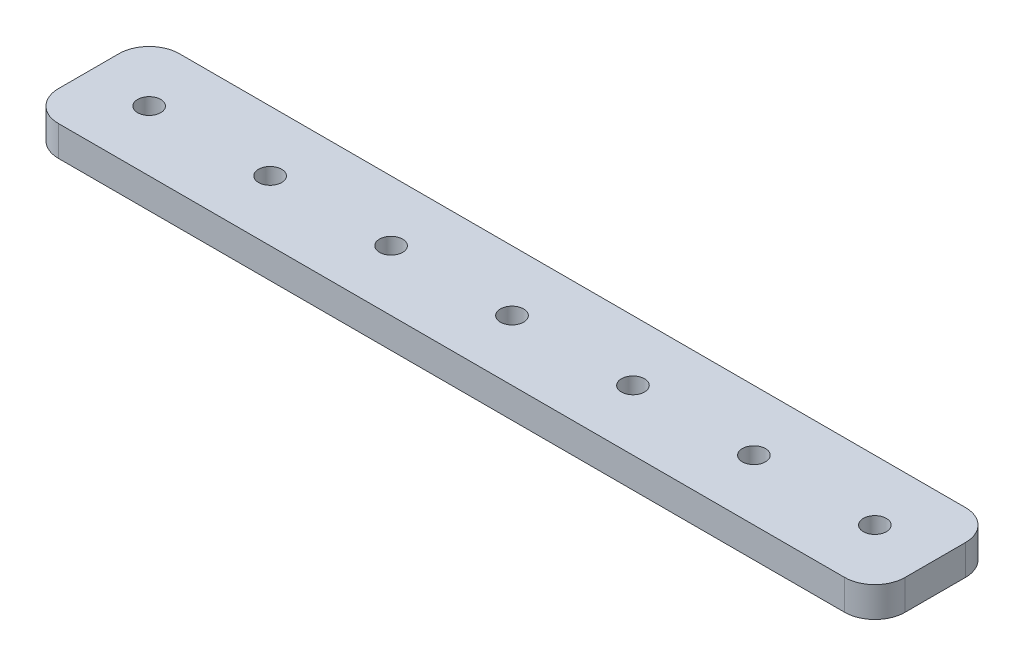
ISO-10303-21;
HEADER;
FILE_DESCRIPTION(('STEP AP214'),'2;1');
FILE_NAME('part.step','',(''),(''),'','','');
FILE_SCHEMA(('AUTOMOTIVE_DESIGN { 1 0 10303 214 1 1 1 1 }'));
ENDSEC;
DATA;
#1=APPLICATION_CONTEXT('core data for automotive mechanical design processes');
#2=APPLICATION_PROTOCOL_DEFINITION('international standard','automotive_design',2000,#1);
#3=PRODUCT_CONTEXT('',#1,'mechanical');
#4=PRODUCT('Part','Part','',(#3));
#5=PRODUCT_RELATED_PRODUCT_CATEGORY('part','',(#4));
#6=PRODUCT_DEFINITION_FORMATION('','',#4);
#7=PRODUCT_DEFINITION_CONTEXT('part definition',#1,'design');
#8=PRODUCT_DEFINITION('design','',#6,#7);
#9=PRODUCT_DEFINITION_SHAPE('','',#8);
#10=(LENGTH_UNIT() NAMED_UNIT(*) SI_UNIT(.MILLI.,.METRE.));
#11=(NAMED_UNIT(*) PLANE_ANGLE_UNIT() SI_UNIT($,.RADIAN.));
#12=(NAMED_UNIT(*) SI_UNIT($,.STERADIAN.) SOLID_ANGLE_UNIT());
#13=UNCERTAINTY_MEASURE_WITH_UNIT(LENGTH_MEASURE(1.E-05),#10,'distance_accuracy_value','');
#14=(GEOMETRIC_REPRESENTATION_CONTEXT(3) GLOBAL_UNCERTAINTY_ASSIGNED_CONTEXT((#13)) GLOBAL_UNIT_ASSIGNED_CONTEXT((#10,
#11,#12)) REPRESENTATION_CONTEXT('',''));
#15=CARTESIAN_POINT('',(0.,0.,0.));
#16=DIRECTION('',(0.,0.,1.));
#17=DIRECTION('',(1.,0.,0.));
#18=AXIS2_PLACEMENT_3D('',#15,#16,#17);
#19=CARTESIAN_POINT('',(0.,6.35,0.));
#20=DIRECTION('',(1.,0.,0.));
#21=DIRECTION('',(0.,0.,-1.));
#22=AXIS2_PLACEMENT_3D('',#19,#20,#21);
#23=PLANE('',#22);
#24=DIRECTION('',(0.,0.,1.));
#25=VECTOR('',#24,1.);
#26=CARTESIAN_POINT('',(0.,0.,0.));
#27=LINE('',#26,#25);
#28=CARTESIAN_POINT('',(0.,0.,-19.05));
#29=VERTEX_POINT('',#28);
#30=CARTESIAN_POINT('',(0.,0.,-6.35000000000001));
#31=VERTEX_POINT('',#30);
#32=EDGE_CURVE('E181',#29,#31,#27,.T.);
#33=ORIENTED_EDGE('',*,*,#32,.T.);
#34=DIRECTION('',(0.,-1.,0.));
#35=VECTOR('',#34,1.);
#36=CARTESIAN_POINT('',(0.,6.35,-6.35000000000001));
#37=LINE('',#36,#35);
#38=CARTESIAN_POINT('',(0.,6.35,-6.35000000000001));
#39=VERTEX_POINT('',#38);
#40=EDGE_CURVE('E11',#31,#39,#37,.F.);
#41=ORIENTED_EDGE('',*,*,#40,.T.);
#42=DIRECTION('',(0.,0.,1.));
#43=VECTOR('',#42,1.);
#44=CARTESIAN_POINT('',(0.,6.35,0.));
#45=LINE('',#44,#43);
#46=CARTESIAN_POINT('',(0.,6.35,-19.05));
#47=VERTEX_POINT('',#46);
#48=EDGE_CURVE('E134',#47,#39,#45,.T.);
#49=ORIENTED_EDGE('',*,*,#48,.F.);
#50=DIRECTION('',(0.,-1.,0.));
#51=VECTOR('',#50,1.);
#52=CARTESIAN_POINT('',(0.,6.35,-19.05));
#53=LINE('',#52,#51);
#54=EDGE_CURVE('E47',#47,#29,#53,.T.);
#55=ORIENTED_EDGE('',*,*,#54,.T.);
#56=EDGE_LOOP('',(#33,#41,#49,#55));
#57=FACE_BOUND('',#56,.T.);
#58=ADVANCED_FACE('F38',(#57),#23,.F.);
#59=CARTESIAN_POINT('',(0.,6.35,0.));
#60=DIRECTION('',(0.,0.,-1.));
#61=DIRECTION('',(-1.,0.,0.));
#62=AXIS2_PLACEMENT_3D('',#59,#60,#61);
#63=PLANE('',#62);
#64=DIRECTION('',(1.,0.,0.));
#65=VECTOR('',#64,1.);
#66=CARTESIAN_POINT('',(0.,0.,0.));
#67=LINE('',#66,#65);
#68=CARTESIAN_POINT('',(6.35000000000001,0.,0.));
#69=VERTEX_POINT('',#68);
#70=CARTESIAN_POINT('',(171.45,0.,0.));
#71=VERTEX_POINT('',#70);
#72=EDGE_CURVE('E141',#69,#71,#67,.T.);
#73=ORIENTED_EDGE('',*,*,#72,.T.);
#74=DIRECTION('',(0.,-1.,0.));
#75=VECTOR('',#74,1.);
#76=CARTESIAN_POINT('',(171.45,6.35,0.));
#77=LINE('',#76,#75);
#78=CARTESIAN_POINT('',(171.45,6.35,0.));
#79=VERTEX_POINT('',#78);
#80=EDGE_CURVE('E54',#71,#79,#77,.F.);
#81=ORIENTED_EDGE('',*,*,#80,.T.);
#82=DIRECTION('',(1.,0.,0.));
#83=VECTOR('',#82,1.);
#84=CARTESIAN_POINT('',(0.,6.35,0.));
#85=LINE('',#84,#83);
#86=CARTESIAN_POINT('',(6.35000000000001,6.35,0.));
#87=VERTEX_POINT('',#86);
#88=EDGE_CURVE('E139',#87,#79,#85,.T.);
#89=ORIENTED_EDGE('',*,*,#88,.F.);
#90=DIRECTION('',(0.,-1.,0.));
#91=VECTOR('',#90,1.);
#92=CARTESIAN_POINT('',(6.35000000000001,6.35,0.));
#93=LINE('',#92,#91);
#94=EDGE_CURVE('E170',#87,#69,#93,.T.);
#95=ORIENTED_EDGE('',*,*,#94,.T.);
#96=EDGE_LOOP('',(#73,#81,#89,#95));
#97=FACE_BOUND('',#96,.T.);
#98=ADVANCED_FACE('F279',(#97),#63,.F.);
#99=CARTESIAN_POINT('',(177.8,6.35,0.));
#100=DIRECTION('',(-1.,0.,0.));
#101=DIRECTION('',(0.,0.,1.));
#102=AXIS2_PLACEMENT_3D('',#99,#100,#101);
#103=PLANE('',#102);
#104=DIRECTION('',(0.,0.,-1.));
#105=VECTOR('',#104,1.);
#106=CARTESIAN_POINT('',(177.8,0.,0.));
#107=LINE('',#106,#105);
#108=CARTESIAN_POINT('',(177.8,0.,-6.34999999999999));
#109=VERTEX_POINT('',#108);
#110=CARTESIAN_POINT('',(177.8,0.,-19.05));
#111=VERTEX_POINT('',#110);
#112=EDGE_CURVE('E135',#109,#111,#107,.T.);
#113=ORIENTED_EDGE('',*,*,#112,.T.);
#114=DIRECTION('',(0.,-1.,0.));
#115=VECTOR('',#114,1.);
#116=CARTESIAN_POINT('',(177.8,6.35,-19.05));
#117=LINE('',#116,#115);
#118=CARTESIAN_POINT('',(177.8,6.35,-19.05));
#119=VERTEX_POINT('',#118);
#120=EDGE_CURVE('E110',#111,#119,#117,.F.);
#121=ORIENTED_EDGE('',*,*,#120,.T.);
#122=DIRECTION('',(0.,0.,-1.));
#123=VECTOR('',#122,1.);
#124=CARTESIAN_POINT('',(177.8,6.35,0.));
#125=LINE('',#124,#123);
#126=CARTESIAN_POINT('',(177.8,6.35,-6.34999999999999));
#127=VERTEX_POINT('',#126);
#128=EDGE_CURVE('E197',#127,#119,#125,.T.);
#129=ORIENTED_EDGE('',*,*,#128,.F.);
#130=DIRECTION('',(0.,-1.,0.));
#131=VECTOR('',#130,1.);
#132=CARTESIAN_POINT('',(177.8,6.35,-6.34999999999999));
#133=LINE('',#132,#131);
#134=EDGE_CURVE('E116',#127,#109,#133,.T.);
#135=ORIENTED_EDGE('',*,*,#134,.T.);
#136=EDGE_LOOP('',(#113,#121,#129,#135));
#137=FACE_BOUND('',#136,.T.);
#138=ADVANCED_FACE('F276',(#137),#103,.F.);
#139=CARTESIAN_POINT('',(0.,6.35,-25.4));
#140=DIRECTION('',(0.,0.,1.));
#141=DIRECTION('',(1.,0.,0.));
#142=AXIS2_PLACEMENT_3D('',#139,#140,#141);
#143=PLANE('',#142);
#144=DIRECTION('',(-1.,0.,0.));
#145=VECTOR('',#144,1.);
#146=CARTESIAN_POINT('',(0.,6.35,-25.4));
#147=LINE('',#146,#145);
#148=CARTESIAN_POINT('',(171.45,6.35,-25.4));
#149=VERTEX_POINT('',#148);
#150=CARTESIAN_POINT('',(6.35000000000002,6.35,-25.4));
#151=VERTEX_POINT('',#150);
#152=EDGE_CURVE('E126',#149,#151,#147,.T.);
#153=ORIENTED_EDGE('',*,*,#152,.F.);
#154=DIRECTION('',(0.,-1.,0.));
#155=VECTOR('',#154,1.);
#156=CARTESIAN_POINT('',(171.45,6.35,-25.4));
#157=LINE('',#156,#155);
#158=CARTESIAN_POINT('',(171.45,0.,-25.4));
#159=VERTEX_POINT('',#158);
#160=EDGE_CURVE('E109',#149,#159,#157,.T.);
#161=ORIENTED_EDGE('',*,*,#160,.T.);
#162=DIRECTION('',(-1.,0.,0.));
#163=VECTOR('',#162,1.);
#164=CARTESIAN_POINT('',(0.,0.,-25.4));
#165=LINE('',#164,#163);
#166=CARTESIAN_POINT('',(6.35000000000002,0.,-25.4));
#167=VERTEX_POINT('',#166);
#168=EDGE_CURVE('E123',#159,#167,#165,.T.);
#169=ORIENTED_EDGE('',*,*,#168,.T.);
#170=DIRECTION('',(0.,-1.,0.));
#171=VECTOR('',#170,1.);
#172=CARTESIAN_POINT('',(6.35000000000002,6.35,-25.4));
#173=LINE('',#172,#171);
#174=EDGE_CURVE('E129',#167,#151,#173,.F.);
#175=ORIENTED_EDGE('',*,*,#174,.T.);
#176=EDGE_LOOP('',(#153,#161,#169,#175));
#177=FACE_BOUND('',#176,.T.);
#178=ADVANCED_FACE('F122',(#177),#143,.F.);
#179=CARTESIAN_POINT('',(0.,6.35,0.));
#180=DIRECTION('',(0.,-1.,0.));
#181=DIRECTION('',(0.,0.,-1.));
#182=AXIS2_PLACEMENT_3D('',#179,#180,#181);
#183=PLANE('',#182);
#184=CARTESIAN_POINT('',(12.7,6.35,-12.7));
#185=DIRECTION('',(0.,1.,0.));
#186=DIRECTION('',(0.,0.,1.));
#187=AXIS2_PLACEMENT_3D('',#184,#185,#186);
#188=CIRCLE('',#187,2.425);
#189=CARTESIAN_POINT('',(12.7,6.35,-10.275));
#190=VERTEX_POINT('',#189);
#191=EDGE_CURVE('E192',#190,#190,#188,.T.);
#192=ORIENTED_EDGE('',*,*,#191,.F.);
#193=EDGE_LOOP('',(#192));
#194=FACE_BOUND('',#193,.T.);
#195=CARTESIAN_POINT('',(38.1,6.35,-12.7));
#196=DIRECTION('',(0.,1.,0.));
#197=DIRECTION('',(0.,0.,1.));
#198=AXIS2_PLACEMENT_3D('',#195,#196,#197);
#199=CIRCLE('',#198,2.425);
#200=CARTESIAN_POINT('',(38.1,6.35,-10.275));
#201=VERTEX_POINT('',#200);
#202=EDGE_CURVE('E243',#201,#201,#199,.T.);
#203=ORIENTED_EDGE('',*,*,#202,.F.);
#204=EDGE_LOOP('',(#203));
#205=FACE_BOUND('',#204,.T.);
#206=CARTESIAN_POINT('',(63.5,6.35,-12.7));
#207=DIRECTION('',(0.,1.,0.));
#208=DIRECTION('',(0.,0.,1.));
#209=AXIS2_PLACEMENT_3D('',#206,#207,#208);
#210=CIRCLE('',#209,2.425);
#211=CARTESIAN_POINT('',(63.5,6.35,-10.275));
#212=VERTEX_POINT('',#211);
#213=EDGE_CURVE('E235',#212,#212,#210,.T.);
#214=ORIENTED_EDGE('',*,*,#213,.F.);
#215=EDGE_LOOP('',(#214));
#216=FACE_BOUND('',#215,.T.);
#217=CARTESIAN_POINT('',(88.9,6.35,-12.7));
#218=DIRECTION('',(0.,1.,0.));
#219=DIRECTION('',(0.,0.,1.));
#220=AXIS2_PLACEMENT_3D('',#217,#218,#219);
#221=CIRCLE('',#220,2.425);
#222=CARTESIAN_POINT('',(88.9,6.35,-10.275));
#223=VERTEX_POINT('',#222);
#224=EDGE_CURVE('E227',#223,#223,#221,.T.);
#225=ORIENTED_EDGE('',*,*,#224,.F.);
#226=EDGE_LOOP('',(#225));
#227=FACE_BOUND('',#226,.T.);
#228=CARTESIAN_POINT('',(114.3,6.35,-12.7));
#229=DIRECTION('',(0.,1.,0.));
#230=DIRECTION('',(0.,0.,1.));
#231=AXIS2_PLACEMENT_3D('',#228,#229,#230);
#232=CIRCLE('',#231,2.425);
#233=CARTESIAN_POINT('',(114.3,6.35,-10.275));
#234=VERTEX_POINT('',#233);
#235=EDGE_CURVE('E219',#234,#234,#232,.T.);
#236=ORIENTED_EDGE('',*,*,#235,.F.);
#237=EDGE_LOOP('',(#236));
#238=FACE_BOUND('',#237,.T.);
#239=CARTESIAN_POINT('',(139.7,6.35,-12.7));
#240=DIRECTION('',(0.,1.,0.));
#241=DIRECTION('',(0.,0.,1.));
#242=AXIS2_PLACEMENT_3D('',#239,#240,#241);
#243=CIRCLE('',#242,2.42500000000001);
#244=CARTESIAN_POINT('',(139.7,6.35,-10.275));
#245=VERTEX_POINT('',#244);
#246=EDGE_CURVE('E211',#245,#245,#243,.T.);
#247=ORIENTED_EDGE('',*,*,#246,.F.);
#248=EDGE_LOOP('',(#247));
#249=FACE_BOUND('',#248,.T.);
#250=CARTESIAN_POINT('',(165.1,6.35,-12.7));
#251=DIRECTION('',(0.,1.,0.));
#252=DIRECTION('',(0.,0.,1.));
#253=AXIS2_PLACEMENT_3D('',#250,#251,#252);
#254=CIRCLE('',#253,2.42500000000001);
#255=CARTESIAN_POINT('',(165.1,6.35,-10.275));
#256=VERTEX_POINT('',#255);
#257=EDGE_CURVE('E203',#256,#256,#254,.T.);
#258=ORIENTED_EDGE('',*,*,#257,.F.);
#259=EDGE_LOOP('',(#258));
#260=FACE_BOUND('',#259,.T.);
#261=ORIENTED_EDGE('',*,*,#128,.T.);
#262=CARTESIAN_POINT('',(171.45,6.35,-19.05));
#263=DIRECTION('',(0.,-1.,0.));
#264=DIRECTION('',(0.,0.,-1.));
#265=AXIS2_PLACEMENT_3D('',#262,#263,#264);
#266=CIRCLE('',#265,6.35);
#267=EDGE_CURVE('E167',#119,#149,#266,.F.);
#268=ORIENTED_EDGE('',*,*,#267,.T.);
#269=ORIENTED_EDGE('',*,*,#152,.T.);
#270=CARTESIAN_POINT('',(6.35000000000002,6.35,-19.05));
#271=DIRECTION('',(0.,-1.,0.));
#272=DIRECTION('',(0.,0.,-1.));
#273=AXIS2_PLACEMENT_3D('',#270,#271,#272);
#274=CIRCLE('',#273,6.35);
#275=EDGE_CURVE('E159',#151,#47,#274,.F.);
#276=ORIENTED_EDGE('',*,*,#275,.T.);
#277=ORIENTED_EDGE('',*,*,#48,.T.);
#278=CARTESIAN_POINT('',(6.35000000000001,6.35,-6.35));
#279=DIRECTION('',(0.,-1.,0.));
#280=DIRECTION('',(0.,0.,-1.));
#281=AXIS2_PLACEMENT_3D('',#278,#279,#280);
#282=CIRCLE('',#281,6.35);
#283=EDGE_CURVE('E61',#39,#87,#282,.F.);
#284=ORIENTED_EDGE('',*,*,#283,.T.);
#285=ORIENTED_EDGE('',*,*,#88,.T.);
#286=CARTESIAN_POINT('',(171.45,6.35,-6.35));
#287=DIRECTION('',(0.,-1.,0.));
#288=DIRECTION('',(0.,0.,-1.));
#289=AXIS2_PLACEMENT_3D('',#286,#287,#288);
#290=CIRCLE('',#289,6.35);
#291=EDGE_CURVE('E164',#79,#127,#290,.F.);
#292=ORIENTED_EDGE('',*,*,#291,.T.);
#293=EDGE_LOOP('',(#261,#268,#269,#276,#277,#284,#285,#292));
#294=FACE_BOUND('',#293,.T.);
#295=ADVANCED_FACE('F257',(#194,#205,#216,#227,#238,#249,#260,#294),#183,.F.);
#296=CARTESIAN_POINT('',(0.,0.,0.));
#297=DIRECTION('',(0.,-1.,0.));
#298=DIRECTION('',(0.,0.,-1.));
#299=AXIS2_PLACEMENT_3D('',#296,#297,#298);
#300=PLANE('',#299);
#301=CARTESIAN_POINT('',(12.7,0.,-12.7));
#302=DIRECTION('',(0.,1.,0.));
#303=DIRECTION('',(0.,0.,1.));
#304=AXIS2_PLACEMENT_3D('',#301,#302,#303);
#305=CIRCLE('',#304,2.425);
#306=CARTESIAN_POINT('',(12.7,0.,-10.275));
#307=VERTEX_POINT('',#306);
#308=EDGE_CURVE('E187',#307,#307,#305,.T.);
#309=ORIENTED_EDGE('',*,*,#308,.T.);
#310=EDGE_LOOP('',(#309));
#311=FACE_BOUND('',#310,.T.);
#312=CARTESIAN_POINT('',(38.1,0.,-12.7));
#313=DIRECTION('',(0.,1.,0.));
#314=DIRECTION('',(0.,0.,1.));
#315=AXIS2_PLACEMENT_3D('',#312,#313,#314);
#316=CIRCLE('',#315,2.425);
#317=CARTESIAN_POINT('',(38.1,0.,-10.275));
#318=VERTEX_POINT('',#317);
#319=EDGE_CURVE('E247',#318,#318,#316,.T.);
#320=ORIENTED_EDGE('',*,*,#319,.T.);
#321=EDGE_LOOP('',(#320));
#322=FACE_BOUND('',#321,.T.);
#323=CARTESIAN_POINT('',(63.5,0.,-12.7));
#324=DIRECTION('',(0.,1.,0.));
#325=DIRECTION('',(0.,0.,1.));
#326=AXIS2_PLACEMENT_3D('',#323,#324,#325);
#327=CIRCLE('',#326,2.425);
#328=CARTESIAN_POINT('',(63.5,0.,-10.275));
#329=VERTEX_POINT('',#328);
#330=EDGE_CURVE('E239',#329,#329,#327,.T.);
#331=ORIENTED_EDGE('',*,*,#330,.T.);
#332=EDGE_LOOP('',(#331));
#333=FACE_BOUND('',#332,.T.);
#334=CARTESIAN_POINT('',(88.9,0.,-12.7));
#335=DIRECTION('',(0.,1.,0.));
#336=DIRECTION('',(0.,0.,1.));
#337=AXIS2_PLACEMENT_3D('',#334,#335,#336);
#338=CIRCLE('',#337,2.425);
#339=CARTESIAN_POINT('',(88.9,0.,-10.275));
#340=VERTEX_POINT('',#339);
#341=EDGE_CURVE('E231',#340,#340,#338,.T.);
#342=ORIENTED_EDGE('',*,*,#341,.T.);
#343=EDGE_LOOP('',(#342));
#344=FACE_BOUND('',#343,.T.);
#345=CARTESIAN_POINT('',(114.3,0.,-12.7));
#346=DIRECTION('',(0.,1.,0.));
#347=DIRECTION('',(0.,0.,1.));
#348=AXIS2_PLACEMENT_3D('',#345,#346,#347);
#349=CIRCLE('',#348,2.425);
#350=CARTESIAN_POINT('',(114.3,0.,-10.275));
#351=VERTEX_POINT('',#350);
#352=EDGE_CURVE('E223',#351,#351,#349,.T.);
#353=ORIENTED_EDGE('',*,*,#352,.T.);
#354=EDGE_LOOP('',(#353));
#355=FACE_BOUND('',#354,.T.);
#356=CARTESIAN_POINT('',(139.7,0.,-12.7));
#357=DIRECTION('',(0.,1.,0.));
#358=DIRECTION('',(0.,0.,1.));
#359=AXIS2_PLACEMENT_3D('',#356,#357,#358);
#360=CIRCLE('',#359,2.42500000000001);
#361=CARTESIAN_POINT('',(139.7,0.,-10.275));
#362=VERTEX_POINT('',#361);
#363=EDGE_CURVE('E215',#362,#362,#360,.T.);
#364=ORIENTED_EDGE('',*,*,#363,.T.);
#365=EDGE_LOOP('',(#364));
#366=FACE_BOUND('',#365,.T.);
#367=CARTESIAN_POINT('',(165.1,0.,-12.7));
#368=DIRECTION('',(0.,1.,0.));
#369=DIRECTION('',(0.,0.,1.));
#370=AXIS2_PLACEMENT_3D('',#367,#368,#369);
#371=CIRCLE('',#370,2.42500000000001);
#372=CARTESIAN_POINT('',(165.1,0.,-10.275));
#373=VERTEX_POINT('',#372);
#374=EDGE_CURVE('E207',#373,#373,#371,.T.);
#375=ORIENTED_EDGE('',*,*,#374,.T.);
#376=EDGE_LOOP('',(#375));
#377=FACE_BOUND('',#376,.T.);
#378=ORIENTED_EDGE('',*,*,#168,.F.);
#379=CARTESIAN_POINT('',(171.45,0.,-19.05));
#380=DIRECTION('',(0.,-1.,0.));
#381=DIRECTION('',(0.,0.,-1.));
#382=AXIS2_PLACEMENT_3D('',#379,#380,#381);
#383=CIRCLE('',#382,6.35);
#384=EDGE_CURVE('E105',#159,#111,#383,.T.);
#385=ORIENTED_EDGE('',*,*,#384,.T.);
#386=ORIENTED_EDGE('',*,*,#112,.F.);
#387=CARTESIAN_POINT('',(171.45,0.,-6.35));
#388=DIRECTION('',(0.,-1.,0.));
#389=DIRECTION('',(0.,0.,-1.));
#390=AXIS2_PLACEMENT_3D('',#387,#388,#389);
#391=CIRCLE('',#390,6.35);
#392=EDGE_CURVE('E117',#109,#71,#391,.T.);
#393=ORIENTED_EDGE('',*,*,#392,.T.);
#394=ORIENTED_EDGE('',*,*,#72,.F.);
#395=CARTESIAN_POINT('',(6.35000000000001,0.,-6.35));
#396=DIRECTION('',(0.,-1.,0.));
#397=DIRECTION('',(0.,0.,-1.));
#398=AXIS2_PLACEMENT_3D('',#395,#396,#397);
#399=CIRCLE('',#398,6.35);
#400=EDGE_CURVE('E149',#69,#31,#399,.T.);
#401=ORIENTED_EDGE('',*,*,#400,.T.);
#402=ORIENTED_EDGE('',*,*,#32,.F.);
#403=CARTESIAN_POINT('',(6.35000000000002,0.,-19.05));
#404=DIRECTION('',(0.,-1.,0.));
#405=DIRECTION('',(0.,0.,-1.));
#406=AXIS2_PLACEMENT_3D('',#403,#404,#405);
#407=CIRCLE('',#406,6.35);
#408=EDGE_CURVE('E128',#29,#167,#407,.T.);
#409=ORIENTED_EDGE('',*,*,#408,.T.);
#410=EDGE_LOOP('',(#378,#385,#386,#393,#394,#401,#402,#409));
#411=FACE_BOUND('',#410,.T.);
#412=ADVANCED_FACE('F131',(#311,#322,#333,#344,#355,#366,#377,#411),#300,.T.);
#413=CARTESIAN_POINT('',(165.1,0.,-12.7));
#414=DIRECTION('',(0.,1.,0.));
#415=DIRECTION('',(0.,0.,1.));
#416=AXIS2_PLACEMENT_3D('',#413,#414,#415);
#417=CYLINDRICAL_SURFACE('',#416,2.42500000000001);
#418=ORIENTED_EDGE('',*,*,#374,.F.);
#419=EDGE_LOOP('',(#418));
#420=FACE_BOUND('',#419,.T.);
#421=ORIENTED_EDGE('',*,*,#257,.T.);
#422=EDGE_LOOP('',(#421));
#423=FACE_BOUND('',#422,.T.);
#424=ADVANCED_FACE('F372',(#420,#423),#417,.F.);
#425=CARTESIAN_POINT('',(139.7,0.,-12.7));
#426=DIRECTION('',(0.,1.,0.));
#427=DIRECTION('',(0.,0.,1.));
#428=AXIS2_PLACEMENT_3D('',#425,#426,#427);
#429=CYLINDRICAL_SURFACE('',#428,2.42500000000001);
#430=ORIENTED_EDGE('',*,*,#363,.F.);
#431=EDGE_LOOP('',(#430));
#432=FACE_BOUND('',#431,.T.);
#433=ORIENTED_EDGE('',*,*,#246,.T.);
#434=EDGE_LOOP('',(#433));
#435=FACE_BOUND('',#434,.T.);
#436=ADVANCED_FACE('F363',(#432,#435),#429,.F.);
#437=CARTESIAN_POINT('',(114.3,0.,-12.7));
#438=DIRECTION('',(0.,1.,0.));
#439=DIRECTION('',(0.,0.,1.));
#440=AXIS2_PLACEMENT_3D('',#437,#438,#439);
#441=CYLINDRICAL_SURFACE('',#440,2.425);
#442=ORIENTED_EDGE('',*,*,#352,.F.);
#443=EDGE_LOOP('',(#442));
#444=FACE_BOUND('',#443,.T.);
#445=ORIENTED_EDGE('',*,*,#235,.T.);
#446=EDGE_LOOP('',(#445));
#447=FACE_BOUND('',#446,.T.);
#448=ADVANCED_FACE('F354',(#444,#447),#441,.F.);
#449=CARTESIAN_POINT('',(88.9,0.,-12.7));
#450=DIRECTION('',(0.,1.,0.));
#451=DIRECTION('',(0.,0.,1.));
#452=AXIS2_PLACEMENT_3D('',#449,#450,#451);
#453=CYLINDRICAL_SURFACE('',#452,2.425);
#454=ORIENTED_EDGE('',*,*,#341,.F.);
#455=EDGE_LOOP('',(#454));
#456=FACE_BOUND('',#455,.T.);
#457=ORIENTED_EDGE('',*,*,#224,.T.);
#458=EDGE_LOOP('',(#457));
#459=FACE_BOUND('',#458,.T.);
#460=ADVANCED_FACE('F345',(#456,#459),#453,.F.);
#461=CARTESIAN_POINT('',(63.5,0.,-12.7));
#462=DIRECTION('',(0.,1.,0.));
#463=DIRECTION('',(0.,0.,1.));
#464=AXIS2_PLACEMENT_3D('',#461,#462,#463);
#465=CYLINDRICAL_SURFACE('',#464,2.425);
#466=ORIENTED_EDGE('',*,*,#330,.F.);
#467=EDGE_LOOP('',(#466));
#468=FACE_BOUND('',#467,.T.);
#469=ORIENTED_EDGE('',*,*,#213,.T.);
#470=EDGE_LOOP('',(#469));
#471=FACE_BOUND('',#470,.T.);
#472=ADVANCED_FACE('F336',(#468,#471),#465,.F.);
#473=CARTESIAN_POINT('',(38.1,0.,-12.7));
#474=DIRECTION('',(0.,1.,0.));
#475=DIRECTION('',(0.,0.,1.));
#476=AXIS2_PLACEMENT_3D('',#473,#474,#475);
#477=CYLINDRICAL_SURFACE('',#476,2.425);
#478=ORIENTED_EDGE('',*,*,#319,.F.);
#479=EDGE_LOOP('',(#478));
#480=FACE_BOUND('',#479,.T.);
#481=ORIENTED_EDGE('',*,*,#202,.T.);
#482=EDGE_LOOP('',(#481));
#483=FACE_BOUND('',#482,.T.);
#484=ADVANCED_FACE('F327',(#480,#483),#477,.F.);
#485=CARTESIAN_POINT('',(12.7,0.,-12.7));
#486=DIRECTION('',(0.,1.,0.));
#487=DIRECTION('',(0.,0.,1.));
#488=AXIS2_PLACEMENT_3D('',#485,#486,#487);
#489=CYLINDRICAL_SURFACE('',#488,2.425);
#490=ORIENTED_EDGE('',*,*,#308,.F.);
#491=EDGE_LOOP('',(#490));
#492=FACE_BOUND('',#491,.T.);
#493=ORIENTED_EDGE('',*,*,#191,.T.);
#494=EDGE_LOOP('',(#493));
#495=FACE_BOUND('',#494,.T.);
#496=ADVANCED_FACE('F255',(#492,#495),#489,.F.);
#497=CARTESIAN_POINT('',(171.45,6.35,-19.05));
#498=DIRECTION('',(0.,-1.,0.));
#499=DIRECTION('',(0.,0.,-1.));
#500=AXIS2_PLACEMENT_3D('',#497,#498,#499);
#501=CYLINDRICAL_SURFACE('',#500,6.35);
#502=ORIENTED_EDGE('',*,*,#267,.F.);
#503=ORIENTED_EDGE('',*,*,#120,.F.);
#504=ORIENTED_EDGE('',*,*,#384,.F.);
#505=ORIENTED_EDGE('',*,*,#160,.F.);
#506=EDGE_LOOP('',(#502,#503,#504,#505));
#507=FACE_BOUND('',#506,.T.);
#508=ADVANCED_FACE('F108',(#507),#501,.T.);
#509=CARTESIAN_POINT('',(171.45,6.35,-6.35));
#510=DIRECTION('',(0.,-1.,0.));
#511=DIRECTION('',(0.,0.,-1.));
#512=AXIS2_PLACEMENT_3D('',#509,#510,#511);
#513=CYLINDRICAL_SURFACE('',#512,6.35);
#514=ORIENTED_EDGE('',*,*,#291,.F.);
#515=ORIENTED_EDGE('',*,*,#80,.F.);
#516=ORIENTED_EDGE('',*,*,#392,.F.);
#517=ORIENTED_EDGE('',*,*,#134,.F.);
#518=EDGE_LOOP('',(#514,#515,#516,#517));
#519=FACE_BOUND('',#518,.T.);
#520=ADVANCED_FACE('F278',(#519),#513,.T.);
#521=CARTESIAN_POINT('',(6.35000000000001,6.35,-6.35));
#522=DIRECTION('',(0.,-1.,0.));
#523=DIRECTION('',(0.,0.,-1.));
#524=AXIS2_PLACEMENT_3D('',#521,#522,#523);
#525=CYLINDRICAL_SURFACE('',#524,6.35);
#526=ORIENTED_EDGE('',*,*,#283,.F.);
#527=ORIENTED_EDGE('',*,*,#40,.F.);
#528=ORIENTED_EDGE('',*,*,#400,.F.);
#529=ORIENTED_EDGE('',*,*,#94,.F.);
#530=EDGE_LOOP('',(#526,#527,#528,#529));
#531=FACE_BOUND('',#530,.T.);
#532=ADVANCED_FACE('F282',(#531),#525,.T.);
#533=CARTESIAN_POINT('',(6.35000000000002,6.35,-19.05));
#534=DIRECTION('',(0.,-1.,0.));
#535=DIRECTION('',(0.,0.,-1.));
#536=AXIS2_PLACEMENT_3D('',#533,#534,#535);
#537=CYLINDRICAL_SURFACE('',#536,6.35);
#538=ORIENTED_EDGE('',*,*,#275,.F.);
#539=ORIENTED_EDGE('',*,*,#174,.F.);
#540=ORIENTED_EDGE('',*,*,#408,.F.);
#541=ORIENTED_EDGE('',*,*,#54,.F.);
#542=EDGE_LOOP('',(#538,#539,#540,#541));
#543=FACE_BOUND('',#542,.T.);
#544=ADVANCED_FACE('F40',(#543),#537,.T.);
#545=CLOSED_SHELL('',(#58,#98,#138,#178,#295,#412,#424,#436,#448,#460,#472,#484,#496,#508,#520,
#532,#544));
#546=MANIFOLD_SOLID_BREP('B2',#545);
#547=ADVANCED_BREP_SHAPE_REPRESENTATION('',(#18,#546),#14);
#548=SHAPE_DEFINITION_REPRESENTATION(#9,#547);
ENDSEC;
END-ISO-10303-21;
